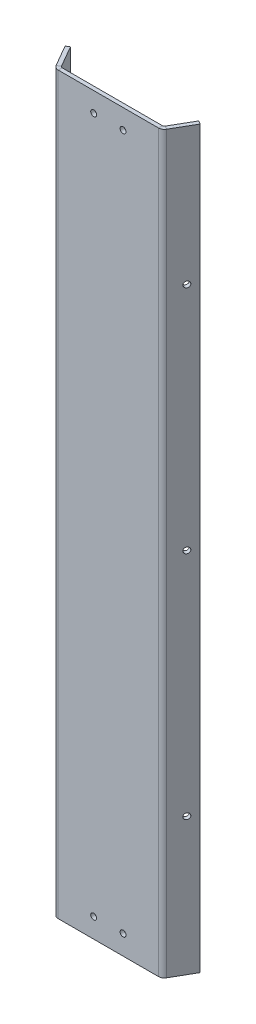
ISO-10303-21;
HEADER;
FILE_DESCRIPTION(('STEP AP214'),'2;1');
FILE_NAME('part.step','',(''),(''),'','','');
FILE_SCHEMA(('AUTOMOTIVE_DESIGN { 1 0 10303 214 1 1 1 1 }'));
ENDSEC;
DATA;
#1=APPLICATION_CONTEXT('core data for automotive mechanical design processes');
#2=APPLICATION_PROTOCOL_DEFINITION('international standard','automotive_design',2000,#1);
#3=PRODUCT_CONTEXT('',#1,'mechanical');
#4=PRODUCT('Part','Part','',(#3));
#5=PRODUCT_RELATED_PRODUCT_CATEGORY('part','',(#4));
#6=PRODUCT_DEFINITION_FORMATION('','',#4);
#7=PRODUCT_DEFINITION_CONTEXT('part definition',#1,'design');
#8=PRODUCT_DEFINITION('design','',#6,#7);
#9=PRODUCT_DEFINITION_SHAPE('','',#8);
#10=(LENGTH_UNIT() NAMED_UNIT(*) SI_UNIT(.MILLI.,.METRE.));
#11=(NAMED_UNIT(*) PLANE_ANGLE_UNIT() SI_UNIT($,.RADIAN.));
#12=(NAMED_UNIT(*) SI_UNIT($,.STERADIAN.) SOLID_ANGLE_UNIT());
#13=UNCERTAINTY_MEASURE_WITH_UNIT(LENGTH_MEASURE(1.E-05),#10,'distance_accuracy_value','');
#14=(GEOMETRIC_REPRESENTATION_CONTEXT(3) GLOBAL_UNCERTAINTY_ASSIGNED_CONTEXT((#13)) GLOBAL_UNIT_ASSIGNED_CONTEXT((#10,
#11,#12)) REPRESENTATION_CONTEXT('',''));
#15=CARTESIAN_POINT('',(0.,0.,0.));
#16=DIRECTION('',(0.,0.,1.));
#17=DIRECTION('',(1.,0.,0.));
#18=AXIS2_PLACEMENT_3D('',#15,#16,#17);
#19=CARTESIAN_POINT('',(0.,0.,2.));
#20=DIRECTION('',(0.,0.,1.));
#21=DIRECTION('',(1.,0.,0.));
#22=AXIS2_PLACEMENT_3D('',#19,#20,#21);
#23=PLANE('',#22);
#24=CARTESIAN_POINT('',(-5.3675504864885,10.,2.));
#25=DIRECTION('',(0.,0.,-1.));
#26=DIRECTION('',(-1.,0.,0.));
#27=AXIS2_PLACEMENT_3D('',#24,#25,#26);
#28=CIRCLE('',#27,1.49999999999999);
#29=CARTESIAN_POINT('',(-6.86755048648849,10.,2.));
#30=VERTEX_POINT('',#29);
#31=EDGE_CURVE('E229',#30,#30,#28,.T.);
#32=ORIENTED_EDGE('',*,*,#31,.F.);
#33=EDGE_LOOP('',(#32));
#34=FACE_BOUND('',#33,.T.);
#35=CARTESIAN_POINT('',(9.6324495135115,10.,2.));
#36=DIRECTION('',(0.,0.,-1.));
#37=DIRECTION('',(-1.,0.,0.));
#38=AXIS2_PLACEMENT_3D('',#35,#36,#37);
#39=CIRCLE('',#38,1.49999999999999);
#40=CARTESIAN_POINT('',(8.13244951351151,10.,2.));
#41=VERTEX_POINT('',#40);
#42=EDGE_CURVE('E226',#41,#41,#39,.T.);
#43=ORIENTED_EDGE('',*,*,#42,.F.);
#44=EDGE_LOOP('',(#43));
#45=FACE_BOUND('',#44,.T.);
#46=CARTESIAN_POINT('',(9.6324495135115,365.,2.));
#47=DIRECTION('',(0.,0.,-1.));
#48=DIRECTION('',(-1.,0.,0.));
#49=AXIS2_PLACEMENT_3D('',#46,#47,#48);
#50=CIRCLE('',#49,1.49999999999999);
#51=CARTESIAN_POINT('',(8.13244951351151,365.,2.));
#52=VERTEX_POINT('',#51);
#53=EDGE_CURVE('E223',#52,#52,#50,.T.);
#54=ORIENTED_EDGE('',*,*,#53,.F.);
#55=EDGE_LOOP('',(#54));
#56=FACE_BOUND('',#55,.T.);
#57=CARTESIAN_POINT('',(-5.3675504864885,365.,2.));
#58=DIRECTION('',(0.,0.,-1.));
#59=DIRECTION('',(-1.,0.,0.));
#60=AXIS2_PLACEMENT_3D('',#57,#58,#59);
#61=CIRCLE('',#60,1.49999999999999);
#62=CARTESIAN_POINT('',(-6.86755048648849,365.,2.));
#63=VERTEX_POINT('',#62);
#64=EDGE_CURVE('E220',#63,#63,#61,.T.);
#65=ORIENTED_EDGE('',*,*,#64,.F.);
#66=EDGE_LOOP('',(#65));
#67=FACE_BOUND('',#66,.T.);
#68=DIRECTION('',(-1.,0.,0.));
#69=VECTOR('',#68,1.);
#70=CARTESIAN_POINT('',(42.3815451542839,375.,2.));
#71=LINE('',#70,#69);
#72=CARTESIAN_POINT('',(27.7097997827011,375.,2.));
#73=VERTEX_POINT('',#72);
#74=CARTESIAN_POINT('',(-23.4449007556781,375.,2.));
#75=VERTEX_POINT('',#74);
#76=EDGE_CURVE('E51',#73,#75,#71,.T.);
#77=ORIENTED_EDGE('',*,*,#76,.F.);
#78=DIRECTION('',(0.,-1.,0.));
#79=VECTOR('',#78,1.);
#80=CARTESIAN_POINT('',(27.7097997827011,0.,2.));
#81=LINE('',#80,#79);
#82=CARTESIAN_POINT('',(27.7097997827011,0.,2.));
#83=VERTEX_POINT('',#82);
#84=EDGE_CURVE('E284',#73,#83,#81,.T.);
#85=ORIENTED_EDGE('',*,*,#84,.T.);
#86=DIRECTION('',(1.,0.,0.));
#87=VECTOR('',#86,1.);
#88=CARTESIAN_POINT('',(-38.1166461272609,0.,2.));
#89=LINE('',#88,#87);
#90=CARTESIAN_POINT('',(-23.4449007556781,0.,2.));
#91=VERTEX_POINT('',#90);
#92=EDGE_CURVE('E207',#91,#83,#89,.T.);
#93=ORIENTED_EDGE('',*,*,#92,.F.);
#94=DIRECTION('',(0.,1.,0.));
#95=VECTOR('',#94,1.);
#96=CARTESIAN_POINT('',(-23.4449007556781,0.,2.));
#97=LINE('',#96,#95);
#98=EDGE_CURVE('E217',#91,#75,#97,.T.);
#99=ORIENTED_EDGE('',*,*,#98,.T.);
#100=EDGE_LOOP('',(#77,#85,#93,#99));
#101=FACE_BOUND('',#100,.T.);
#102=ADVANCED_FACE('F47',(#34,#45,#56,#67,#101),#23,.F.);
#103=CARTESIAN_POINT('',(-13.2733290379958,0.,24.6176790078565));
#104=DIRECTION('',(-0.866025403784439,0.,0.499999999999999));
#105=DIRECTION('',(0.499999999999999,0.,0.866025403784439));
#106=AXIS2_PLACEMENT_3D('',#103,#104,#105);
#107=PLANE('',#106);
#108=CARTESIAN_POINT('',(-29.8316521016262,70.,-4.06217782649105));
#109=DIRECTION('',(-0.866025403784439,0.,0.499999999999999));
#110=DIRECTION('',(0.499999999999999,0.,0.866025403784439));
#111=AXIS2_PLACEMENT_3D('',#108,#109,#110);
#112=CIRCLE('',#111,1.49999999999998);
#113=CARTESIAN_POINT('',(-29.0816521016262,70.,-2.76313972081441));
#114=VERTEX_POINT('',#113);
#115=EDGE_CURVE('E240',#114,#114,#112,.T.);
#116=ORIENTED_EDGE('',*,*,#115,.F.);
#117=EDGE_LOOP('',(#116));
#118=FACE_BOUND('',#117,.T.);
#119=CARTESIAN_POINT('',(-29.831652101626,187.5,-4.06217782649071));
#120=DIRECTION('',(-0.866025403784439,0.,0.499999999999999));
#121=DIRECTION('',(0.499999999999999,0.,0.866025403784439));
#122=AXIS2_PLACEMENT_3D('',#119,#120,#121);
#123=CIRCLE('',#122,1.49999999999998);
#124=CARTESIAN_POINT('',(-29.081652101626,187.5,-2.76313972081407));
#125=VERTEX_POINT('',#124);
#126=EDGE_CURVE('E246',#125,#125,#123,.T.);
#127=ORIENTED_EDGE('',*,*,#126,.F.);
#128=EDGE_LOOP('',(#127));
#129=FACE_BOUND('',#128,.T.);
#130=CARTESIAN_POINT('',(-29.8316521016258,305.,-4.06217782649037));
#131=DIRECTION('',(-0.866025403784439,0.,0.499999999999999));
#132=DIRECTION('',(0.499999999999999,0.,0.866025403784439));
#133=AXIS2_PLACEMENT_3D('',#130,#131,#132);
#134=CIRCLE('',#133,1.49999999999998);
#135=CARTESIAN_POINT('',(-29.0816521016258,305.,-2.76313972081373));
#136=VERTEX_POINT('',#135);
#137=EDGE_CURVE('E252',#136,#136,#134,.T.);
#138=ORIENTED_EDGE('',*,*,#137,.F.);
#139=EDGE_LOOP('',(#138));
#140=FACE_BOUND('',#139,.T.);
#141=DIRECTION('',(0.499999999999999,0.,0.866025403784439));
#142=VECTOR('',#141,1.);
#143=CARTESIAN_POINT('',(-32.3316521016262,0.,-8.39230484541325));
#144=LINE('',#143,#142);
#145=CARTESIAN_POINT('',(-32.3316521016262,0.,-8.39230484541325));
#146=VERTEX_POINT('',#145);
#147=CARTESIAN_POINT('',(-26.0429769670314,0.,2.50000000000005));
#148=VERTEX_POINT('',#147);
#149=EDGE_CURVE('E266',#146,#148,#144,.T.);
#150=ORIENTED_EDGE('',*,*,#149,.T.);
#151=DIRECTION('',(0.,1.,0.));
#152=VECTOR('',#151,1.);
#153=CARTESIAN_POINT('',(-26.0429769670314,0.,2.50000000000003));
#154=LINE('',#153,#152);
#155=CARTESIAN_POINT('',(-26.0429769670314,375.,2.5));
#156=VERTEX_POINT('',#155);
#157=EDGE_CURVE('E278',#148,#156,#154,.T.);
#158=ORIENTED_EDGE('',*,*,#157,.T.);
#159=DIRECTION('',(-0.499999999999999,0.,-0.866025403784439));
#160=VECTOR('',#159,1.);
#161=CARTESIAN_POINT('',(7.91744353914615,375.,61.3211737631036));
#162=LINE('',#161,#160);
#163=CARTESIAN_POINT('',(-32.3316521016262,375.,-8.39230484541327));
#164=VERTEX_POINT('',#163);
#165=EDGE_CURVE('E263',#156,#164,#162,.T.);
#166=ORIENTED_EDGE('',*,*,#165,.T.);
#167=DIRECTION('',(0.,-1.,0.));
#168=VECTOR('',#167,1.);
#169=CARTESIAN_POINT('',(-32.3316521016262,375.,-8.39230484541327));
#170=LINE('',#169,#168);
#171=EDGE_CURVE('E258',#164,#146,#170,.T.);
#172=ORIENTED_EDGE('',*,*,#171,.T.);
#173=EDGE_LOOP('',(#150,#158,#166,#172));
#174=FACE_BOUND('',#173,.T.);
#175=ADVANCED_FACE('F355',(#118,#129,#140,#174),#107,.T.);
#176=CARTESIAN_POINT('',(9.64949434671503,375.,60.3211737631036));
#177=DIRECTION('',(0.,1.,0.));
#178=DIRECTION('',(-0.499999999999999,0.,-0.866025403784439));
#179=AXIS2_PLACEMENT_3D('',#176,#177,#178);
#180=PLANE('',#179);
#181=ORIENTED_EDGE('',*,*,#165,.F.);
#182=DIRECTION('',(0.866025403784439,0.,-0.499999999999999));
#183=VECTOR('',#182,1.);
#184=CARTESIAN_POINT('',(-24.3109261594625,375.,1.50000000000003));
#185=LINE('',#184,#183);
#186=CARTESIAN_POINT('',(-24.3109261594625,375.,1.49999999999999));
#187=VERTEX_POINT('',#186);
#188=EDGE_CURVE('E276',#156,#187,#185,.T.);
#189=ORIENTED_EDGE('',*,*,#188,.T.);
#190=DIRECTION('',(-0.499999999999999,0.,-0.866025403784439));
#191=VECTOR('',#190,1.);
#192=CARTESIAN_POINT('',(9.64949434671503,375.,60.3211737631036));
#193=LINE('',#192,#191);
#194=CARTESIAN_POINT('',(-30.5996012940573,375.,-9.39230484541326));
#195=VERTEX_POINT('',#194);
#196=EDGE_CURVE('E273',#187,#195,#193,.T.);
#197=ORIENTED_EDGE('',*,*,#196,.T.);
#198=DIRECTION('',(-0.866025403784439,0.,0.499999999999999));
#199=VECTOR('',#198,1.);
#200=CARTESIAN_POINT('',(-30.5996012940573,375.,-9.39230484541326));
#201=LINE('',#200,#199);
#202=EDGE_CURVE('E267',#195,#164,#201,.T.);
#203=ORIENTED_EDGE('',*,*,#202,.T.);
#204=EDGE_LOOP('',(#181,#189,#197,#203));
#205=FACE_BOUND('',#204,.T.);
#206=ADVANCED_FACE('F353',(#205),#180,.T.);
#207=CARTESIAN_POINT('',(-30.5996012940574,0.,-9.39230484541324));
#208=DIRECTION('',(0.,-1.,0.));
#209=DIRECTION('',(0.499999999999999,0.,0.866025403784439));
#210=AXIS2_PLACEMENT_3D('',#207,#208,#209);
#211=PLANE('',#210);
#212=DIRECTION('',(0.499999999999999,0.,0.866025403784439));
#213=VECTOR('',#212,1.);
#214=CARTESIAN_POINT('',(-30.5996012940574,0.,-9.39230484541324));
#215=LINE('',#214,#213);
#216=CARTESIAN_POINT('',(-30.5996012940574,0.,-9.39230484541324));
#217=VERTEX_POINT('',#216);
#218=CARTESIAN_POINT('',(-24.3109261594625,0.,1.50000000000005));
#219=VERTEX_POINT('',#218);
#220=EDGE_CURVE('E262',#217,#219,#215,.T.);
#221=ORIENTED_EDGE('',*,*,#220,.T.);
#222=DIRECTION('',(-0.866025403784439,0.,0.499999999999999));
#223=VECTOR('',#222,1.);
#224=CARTESIAN_POINT('',(-24.3109261594626,0.,1.50000000000003));
#225=LINE('',#224,#223);
#226=EDGE_CURVE('E281',#219,#148,#225,.T.);
#227=ORIENTED_EDGE('',*,*,#226,.T.);
#228=ORIENTED_EDGE('',*,*,#149,.F.);
#229=DIRECTION('',(-0.866025403784439,0.,0.499999999999999));
#230=VECTOR('',#229,1.);
#231=CARTESIAN_POINT('',(-30.5996012940574,0.,-9.39230484541324));
#232=LINE('',#231,#230);
#233=EDGE_CURVE('E271',#217,#146,#232,.T.);
#234=ORIENTED_EDGE('',*,*,#233,.F.);
#235=EDGE_LOOP('',(#221,#227,#228,#234));
#236=FACE_BOUND('',#235,.T.);
#237=ADVANCED_FACE('F346',(#236),#211,.T.);
#238=CARTESIAN_POINT('',(-30.5996012940573,375.,-9.39230484541326));
#239=DIRECTION('',(-0.499999999999999,0.,-0.866025403784439));
#240=DIRECTION('',(0.,-1.,0.));
#241=AXIS2_PLACEMENT_3D('',#238,#239,#240);
#242=PLANE('',#241);
#243=ORIENTED_EDGE('',*,*,#171,.F.);
#244=ORIENTED_EDGE('',*,*,#202,.F.);
#245=DIRECTION('',(0.,-1.,0.));
#246=VECTOR('',#245,1.);
#247=CARTESIAN_POINT('',(-30.5996012940573,375.,-9.39230484541326));
#248=LINE('',#247,#246);
#249=EDGE_CURVE('E259',#195,#217,#248,.T.);
#250=ORIENTED_EDGE('',*,*,#249,.T.);
#251=ORIENTED_EDGE('',*,*,#233,.T.);
#252=EDGE_LOOP('',(#243,#244,#250,#251));
#253=FACE_BOUND('',#252,.T.);
#254=ADVANCED_FACE('F350',(#253),#242,.T.);
#255=CARTESIAN_POINT('',(-11.5412782304269,0.,23.6176790078565));
#256=DIRECTION('',(-0.866025403784439,0.,0.499999999999999));
#257=DIRECTION('',(0.499999999999999,0.,0.866025403784439));
#258=AXIS2_PLACEMENT_3D('',#255,#256,#257);
#259=PLANE('',#258);
#260=DIRECTION('',(0.,1.,0.));
#261=VECTOR('',#260,1.);
#262=CARTESIAN_POINT('',(-24.3109261594626,0.,1.50000000000003));
#263=LINE('',#262,#261);
#264=EDGE_CURVE('E270',#219,#187,#263,.T.);
#265=ORIENTED_EDGE('',*,*,#264,.F.);
#266=ORIENTED_EDGE('',*,*,#220,.F.);
#267=ORIENTED_EDGE('',*,*,#249,.F.);
#268=ORIENTED_EDGE('',*,*,#196,.F.);
#269=EDGE_LOOP('',(#265,#266,#267,#268));
#270=FACE_BOUND('',#269,.T.);
#271=CARTESIAN_POINT('',(-28.0996012940572,70.,-5.06217782649113));
#272=DIRECTION('',(-0.866025403784439,0.,0.499999999999999));
#273=DIRECTION('',(0.499999999999999,0.,0.866025403784439));
#274=AXIS2_PLACEMENT_3D('',#271,#272,#273);
#275=CIRCLE('',#274,1.49999999999998);
#276=CARTESIAN_POINT('',(-27.3496012940572,70.,-3.76313972081449));
#277=VERTEX_POINT('',#276);
#278=EDGE_CURVE('E243',#277,#277,#275,.T.);
#279=ORIENTED_EDGE('',*,*,#278,.T.);
#280=EDGE_LOOP('',(#279));
#281=FACE_BOUND('',#280,.T.);
#282=CARTESIAN_POINT('',(-28.099601294057,187.5,-5.06217782649079));
#283=DIRECTION('',(-0.866025403784439,0.,0.499999999999999));
#284=DIRECTION('',(0.499999999999999,0.,0.866025403784439));
#285=AXIS2_PLACEMENT_3D('',#282,#283,#284);
#286=CIRCLE('',#285,1.49999999999998);
#287=CARTESIAN_POINT('',(-27.349601294057,187.5,-3.76313972081415));
#288=VERTEX_POINT('',#287);
#289=EDGE_CURVE('E249',#288,#288,#286,.T.);
#290=ORIENTED_EDGE('',*,*,#289,.T.);
#291=EDGE_LOOP('',(#290));
#292=FACE_BOUND('',#291,.T.);
#293=CARTESIAN_POINT('',(-28.0996012940568,305.,-5.06217782649045));
#294=DIRECTION('',(-0.866025403784439,0.,0.499999999999999));
#295=DIRECTION('',(0.499999999999999,0.,0.866025403784439));
#296=AXIS2_PLACEMENT_3D('',#293,#294,#295);
#297=CIRCLE('',#296,1.49999999999998);
#298=CARTESIAN_POINT('',(-27.3496012940568,305.,-3.76313972081381));
#299=VERTEX_POINT('',#298);
#300=EDGE_CURVE('E255',#299,#299,#297,.T.);
#301=ORIENTED_EDGE('',*,*,#300,.T.);
#302=EDGE_LOOP('',(#301));
#303=FACE_BOUND('',#302,.T.);
#304=ADVANCED_FACE('F342',(#270,#281,#292,#303),#259,.F.);
#305=CARTESIAN_POINT('',(-29.8316521016258,305.,-4.06217782649037));
#306=DIRECTION('',(-0.866025403784439,0.,0.499999999999999));
#307=DIRECTION('',(0.499999999999999,0.,0.866025403784439));
#308=AXIS2_PLACEMENT_3D('',#305,#306,#307);
#309=CYLINDRICAL_SURFACE('',#308,1.49999999999998);
#310=ORIENTED_EDGE('',*,*,#300,.F.);
#311=EDGE_LOOP('',(#310));
#312=FACE_BOUND('',#311,.T.);
#313=ORIENTED_EDGE('',*,*,#137,.T.);
#314=EDGE_LOOP('',(#313));
#315=FACE_BOUND('',#314,.T.);
#316=ADVANCED_FACE('F410',(#312,#315),#309,.F.);
#317=CARTESIAN_POINT('',(-29.831652101626,187.5,-4.06217782649071));
#318=DIRECTION('',(-0.866025403784439,0.,0.499999999999999));
#319=DIRECTION('',(0.499999999999999,0.,0.866025403784439));
#320=AXIS2_PLACEMENT_3D('',#317,#318,#319);
#321=CYLINDRICAL_SURFACE('',#320,1.49999999999998);
#322=ORIENTED_EDGE('',*,*,#289,.F.);
#323=EDGE_LOOP('',(#322));
#324=FACE_BOUND('',#323,.T.);
#325=ORIENTED_EDGE('',*,*,#126,.T.);
#326=EDGE_LOOP('',(#325));
#327=FACE_BOUND('',#326,.T.);
#328=ADVANCED_FACE('F406',(#324,#327),#321,.F.);
#329=CARTESIAN_POINT('',(-29.8316521016262,70.,-4.06217782649105));
#330=DIRECTION('',(-0.866025403784439,0.,0.499999999999999));
#331=DIRECTION('',(0.499999999999999,0.,0.866025403784439));
#332=AXIS2_PLACEMENT_3D('',#329,#330,#331);
#333=CYLINDRICAL_SURFACE('',#332,1.49999999999998);
#334=ORIENTED_EDGE('',*,*,#278,.F.);
#335=EDGE_LOOP('',(#334));
#336=FACE_BOUND('',#335,.T.);
#337=ORIENTED_EDGE('',*,*,#115,.T.);
#338=EDGE_LOOP('',(#337));
#339=FACE_BOUND('',#338,.T.);
#340=ADVANCED_FACE('F392',(#336,#339),#333,.F.);
#341=CARTESIAN_POINT('',(-5.3675504864885,10.,2.));
#342=DIRECTION('',(0.,0.,-1.));
#343=DIRECTION('',(-1.,0.,0.));
#344=AXIS2_PLACEMENT_3D('',#341,#342,#343);
#345=CYLINDRICAL_SURFACE('',#344,1.49999999999999);
#346=CARTESIAN_POINT('',(-5.3675504864885,10.,4.00000000000001));
#347=DIRECTION('',(0.,0.,-1.));
#348=DIRECTION('',(-1.,0.,0.));
#349=AXIS2_PLACEMENT_3D('',#346,#347,#348);
#350=CIRCLE('',#349,1.49999999999999);
#351=CARTESIAN_POINT('',(-6.86755048648849,10.,4.00000000000001));
#352=VERTEX_POINT('',#351);
#353=EDGE_CURVE('E214',#352,#352,#350,.T.);
#354=ORIENTED_EDGE('',*,*,#353,.F.);
#355=EDGE_LOOP('',(#354));
#356=FACE_BOUND('',#355,.T.);
#357=ORIENTED_EDGE('',*,*,#31,.T.);
#358=EDGE_LOOP('',(#357));
#359=FACE_BOUND('',#358,.T.);
#360=ADVANCED_FACE('F388',(#356,#359),#345,.F.);
#361=CARTESIAN_POINT('',(9.6324495135115,10.,2.));
#362=DIRECTION('',(0.,0.,-1.));
#363=DIRECTION('',(-1.,0.,0.));
#364=AXIS2_PLACEMENT_3D('',#361,#362,#363);
#365=CYLINDRICAL_SURFACE('',#364,1.49999999999999);
#366=CARTESIAN_POINT('',(9.6324495135115,10.,4.00000000000001));
#367=DIRECTION('',(0.,0.,-1.));
#368=DIRECTION('',(-1.,0.,0.));
#369=AXIS2_PLACEMENT_3D('',#366,#367,#368);
#370=CIRCLE('',#369,1.49999999999999);
#371=CARTESIAN_POINT('',(8.13244951351151,10.,4.00000000000001));
#372=VERTEX_POINT('',#371);
#373=EDGE_CURVE('E211',#372,#372,#370,.T.);
#374=ORIENTED_EDGE('',*,*,#373,.F.);
#375=EDGE_LOOP('',(#374));
#376=FACE_BOUND('',#375,.T.);
#377=ORIENTED_EDGE('',*,*,#42,.T.);
#378=EDGE_LOOP('',(#377));
#379=FACE_BOUND('',#378,.T.);
#380=ADVANCED_FACE('F391',(#376,#379),#365,.F.);
#381=CARTESIAN_POINT('',(9.6324495135115,365.,2.));
#382=DIRECTION('',(0.,0.,-1.));
#383=DIRECTION('',(-1.,0.,0.));
#384=AXIS2_PLACEMENT_3D('',#381,#382,#383);
#385=CYLINDRICAL_SURFACE('',#384,1.49999999999999);
#386=CARTESIAN_POINT('',(9.6324495135115,365.,4.00000000000001));
#387=DIRECTION('',(0.,0.,-1.));
#388=DIRECTION('',(-1.,0.,0.));
#389=AXIS2_PLACEMENT_3D('',#386,#387,#388);
#390=CIRCLE('',#389,1.49999999999999);
#391=CARTESIAN_POINT('',(8.13244951351151,365.,4.00000000000001));
#392=VERTEX_POINT('',#391);
#393=EDGE_CURVE('E204',#392,#392,#390,.T.);
#394=ORIENTED_EDGE('',*,*,#393,.F.);
#395=EDGE_LOOP('',(#394));
#396=FACE_BOUND('',#395,.T.);
#397=ORIENTED_EDGE('',*,*,#53,.T.);
#398=EDGE_LOOP('',(#397));
#399=FACE_BOUND('',#398,.T.);
#400=ADVANCED_FACE('F396',(#396,#399),#385,.F.);
#401=CARTESIAN_POINT('',(-5.3675504864885,365.,2.));
#402=DIRECTION('',(0.,0.,-1.));
#403=DIRECTION('',(-1.,0.,0.));
#404=AXIS2_PLACEMENT_3D('',#401,#402,#403);
#405=CYLINDRICAL_SURFACE('',#404,1.49999999999999);
#406=CARTESIAN_POINT('',(-5.3675504864885,365.,4.00000000000001));
#407=DIRECTION('',(0.,0.,-1.));
#408=DIRECTION('',(-1.,0.,0.));
#409=AXIS2_PLACEMENT_3D('',#406,#407,#408);
#410=CIRCLE('',#409,1.49999999999999);
#411=CARTESIAN_POINT('',(-6.86755048648849,365.,4.00000000000001));
#412=VERTEX_POINT('',#411);
#413=EDGE_CURVE('E208',#412,#412,#410,.T.);
#414=ORIENTED_EDGE('',*,*,#413,.F.);
#415=EDGE_LOOP('',(#414));
#416=FACE_BOUND('',#415,.T.);
#417=ORIENTED_EDGE('',*,*,#64,.T.);
#418=EDGE_LOOP('',(#417));
#419=FACE_BOUND('',#418,.T.);
#420=ADVANCED_FACE('F373',(#416,#419),#405,.F.);
#421=CARTESIAN_POINT('',(42.3815451542839,375.,2.));
#422=DIRECTION('',(0.,1.,0.));
#423=DIRECTION('',(-1.,0.,0.));
#424=AXIS2_PLACEMENT_3D('',#421,#422,#423);
#425=PLANE('',#424);
#426=DIRECTION('',(0.,0.,1.));
#427=VECTOR('',#426,1.);
#428=CARTESIAN_POINT('',(27.7097997827011,375.,2.));
#429=LINE('',#428,#427);
#430=CARTESIAN_POINT('',(27.7097997827011,375.,4.));
#431=VERTEX_POINT('',#430);
#432=EDGE_CURVE('E292',#73,#431,#429,.T.);
#433=ORIENTED_EDGE('',*,*,#432,.F.);
#434=ORIENTED_EDGE('',*,*,#76,.T.);
#435=DIRECTION('',(0.,0.,-1.));
#436=VECTOR('',#435,1.);
#437=CARTESIAN_POINT('',(-23.444900755678,375.,2.));
#438=LINE('',#437,#436);
#439=CARTESIAN_POINT('',(-23.444900755678,375.,4.));
#440=VERTEX_POINT('',#439);
#441=EDGE_CURVE('E232',#440,#75,#438,.T.);
#442=ORIENTED_EDGE('',*,*,#441,.F.);
#443=DIRECTION('',(-1.,0.,0.));
#444=VECTOR('',#443,1.);
#445=CARTESIAN_POINT('',(42.3815451542839,375.,4.));
#446=LINE('',#445,#444);
#447=EDGE_CURVE('E72',#431,#440,#446,.T.);
#448=ORIENTED_EDGE('',*,*,#447,.F.);
#449=EDGE_LOOP('',(#433,#434,#442,#448));
#450=FACE_BOUND('',#449,.T.);
#451=ADVANCED_FACE('F300',(#450),#425,.T.);
#452=CARTESIAN_POINT('',(0.,0.,4.));
#453=DIRECTION('',(0.,0.,1.));
#454=DIRECTION('',(1.,0.,0.));
#455=AXIS2_PLACEMENT_3D('',#452,#453,#454);
#456=PLANE('',#455);
#457=DIRECTION('',(0.,-1.,0.));
#458=VECTOR('',#457,1.);
#459=CARTESIAN_POINT('',(27.7097997827011,0.,4.));
#460=LINE('',#459,#458);
#461=CARTESIAN_POINT('',(27.7097997827011,0.,4.));
#462=VERTEX_POINT('',#461);
#463=EDGE_CURVE('E56',#431,#462,#460,.T.);
#464=ORIENTED_EDGE('',*,*,#463,.F.);
#465=ORIENTED_EDGE('',*,*,#447,.T.);
#466=DIRECTION('',(0.,1.,0.));
#467=VECTOR('',#466,1.);
#468=CARTESIAN_POINT('',(-23.4449007556781,0.,4.));
#469=LINE('',#468,#467);
#470=CARTESIAN_POINT('',(-23.4449007556781,0.,4.));
#471=VERTEX_POINT('',#470);
#472=EDGE_CURVE('E235',#471,#440,#469,.T.);
#473=ORIENTED_EDGE('',*,*,#472,.F.);
#474=DIRECTION('',(1.,0.,0.));
#475=VECTOR('',#474,1.);
#476=CARTESIAN_POINT('',(-38.1166461272609,0.,4.));
#477=LINE('',#476,#475);
#478=EDGE_CURVE('E64',#471,#462,#477,.T.);
#479=ORIENTED_EDGE('',*,*,#478,.T.);
#480=EDGE_LOOP('',(#464,#465,#473,#479));
#481=FACE_BOUND('',#480,.T.);
#482=ORIENTED_EDGE('',*,*,#353,.T.);
#483=EDGE_LOOP('',(#482));
#484=FACE_BOUND('',#483,.T.);
#485=ORIENTED_EDGE('',*,*,#373,.T.);
#486=EDGE_LOOP('',(#485));
#487=FACE_BOUND('',#486,.T.);
#488=ORIENTED_EDGE('',*,*,#413,.T.);
#489=EDGE_LOOP('',(#488));
#490=FACE_BOUND('',#489,.T.);
#491=ORIENTED_EDGE('',*,*,#393,.T.);
#492=EDGE_LOOP('',(#491));
#493=FACE_BOUND('',#492,.T.);
#494=ADVANCED_FACE('F298',(#481,#484,#487,#490,#493),#456,.T.);
#495=CARTESIAN_POINT('',(-38.1166461272609,0.,2.));
#496=DIRECTION('',(0.,-1.,0.));
#497=DIRECTION('',(1.,0.,0.));
#498=AXIS2_PLACEMENT_3D('',#495,#496,#497);
#499=PLANE('',#498);
#500=DIRECTION('',(0.,0.,-1.));
#501=VECTOR('',#500,1.);
#502=CARTESIAN_POINT('',(27.7097997827011,0.,2.));
#503=LINE('',#502,#501);
#504=EDGE_CURVE('E12',#462,#83,#503,.T.);
#505=ORIENTED_EDGE('',*,*,#504,.F.);
#506=ORIENTED_EDGE('',*,*,#478,.F.);
#507=DIRECTION('',(0.,0.,1.));
#508=VECTOR('',#507,1.);
#509=CARTESIAN_POINT('',(-23.4449007556781,0.,2.));
#510=LINE('',#509,#508);
#511=EDGE_CURVE('E199',#91,#471,#510,.T.);
#512=ORIENTED_EDGE('',*,*,#511,.F.);
#513=ORIENTED_EDGE('',*,*,#92,.T.);
#514=EDGE_LOOP('',(#505,#506,#512,#513));
#515=FACE_BOUND('',#514,.T.);
#516=ADVANCED_FACE('F49',(#515),#499,.T.);
#517=CARTESIAN_POINT('',(-23.4449007556781,0.,1.));
#518=DIRECTION('',(0.,1.,0.));
#519=DIRECTION('',(-1.,0.,0.));
#520=AXIS2_PLACEMENT_3D('',#517,#518,#519);
#521=PLANE('',#520);
#522=ORIENTED_EDGE('',*,*,#511,.T.);
#523=CARTESIAN_POINT('',(-23.4449007556781,0.,1.));
#524=DIRECTION('',(0.,1.,0.));
#525=DIRECTION('',(-1.,0.,0.));
#526=AXIS2_PLACEMENT_3D('',#523,#524,#525);
#527=CIRCLE('',#526,3.);
#528=EDGE_CURVE('E187',#471,#148,#527,.F.);
#529=ORIENTED_EDGE('',*,*,#528,.T.);
#530=ORIENTED_EDGE('',*,*,#226,.F.);
#531=CARTESIAN_POINT('',(-23.4449007556781,0.,1.));
#532=DIRECTION('',(0.,-1.,0.));
#533=DIRECTION('',(-1.,0.,0.));
#534=AXIS2_PLACEMENT_3D('',#531,#532,#533);
#535=CIRCLE('',#534,0.999999999999998);
#536=EDGE_CURVE('E192',#91,#219,#535,.T.);
#537=ORIENTED_EDGE('',*,*,#536,.F.);
#538=EDGE_LOOP('',(#522,#529,#530,#537));
#539=FACE_BOUND('',#538,.T.);
#540=ADVANCED_FACE('F312',(#539),#521,.F.);
#541=CARTESIAN_POINT('',(-23.444900755678,375.,1.));
#542=DIRECTION('',(0.,-1.,0.));
#543=DIRECTION('',(0.,0.,-1.));
#544=AXIS2_PLACEMENT_3D('',#541,#542,#543);
#545=PLANE('',#544);
#546=ORIENTED_EDGE('',*,*,#188,.F.);
#547=CARTESIAN_POINT('',(-23.444900755678,375.,1.));
#548=DIRECTION('',(0.,1.,0.));
#549=DIRECTION('',(-1.,0.,0.));
#550=AXIS2_PLACEMENT_3D('',#547,#548,#549);
#551=CIRCLE('',#550,3.);
#552=EDGE_CURVE('E196',#156,#440,#551,.T.);
#553=ORIENTED_EDGE('',*,*,#552,.T.);
#554=ORIENTED_EDGE('',*,*,#441,.T.);
#555=CARTESIAN_POINT('',(-23.444900755678,375.,1.));
#556=DIRECTION('',(0.,1.,0.));
#557=DIRECTION('',(0.,0.,-1.));
#558=AXIS2_PLACEMENT_3D('',#555,#556,#557);
#559=CIRCLE('',#558,0.999999999999998);
#560=EDGE_CURVE('E195',#187,#75,#559,.T.);
#561=ORIENTED_EDGE('',*,*,#560,.F.);
#562=EDGE_LOOP('',(#546,#553,#554,#561));
#563=FACE_BOUND('',#562,.T.);
#564=ADVANCED_FACE('F305',(#563),#545,.F.);
#565=CARTESIAN_POINT('',(-23.4449007556781,-187.511181821082,1.));
#566=DIRECTION('',(0.,1.,0.));
#567=DIRECTION('',(-1.,0.,0.));
#568=AXIS2_PLACEMENT_3D('',#565,#566,#567);
#569=CYLINDRICAL_SURFACE('',#568,1.);
#570=ORIENTED_EDGE('',*,*,#560,.T.);
#571=ORIENTED_EDGE('',*,*,#98,.F.);
#572=ORIENTED_EDGE('',*,*,#536,.T.);
#573=ORIENTED_EDGE('',*,*,#264,.T.);
#574=EDGE_LOOP('',(#570,#571,#572,#573));
#575=FACE_BOUND('',#574,.T.);
#576=ADVANCED_FACE('F338',(#575),#569,.F.);
#577=CARTESIAN_POINT('',(-23.4449007556781,-187.511181821082,1.));
#578=DIRECTION('',(0.,1.,0.));
#579=DIRECTION('',(-1.,0.,0.));
#580=AXIS2_PLACEMENT_3D('',#577,#578,#579);
#581=CYLINDRICAL_SURFACE('',#580,3.);
#582=ORIENTED_EDGE('',*,*,#552,.F.);
#583=ORIENTED_EDGE('',*,*,#157,.F.);
#584=ORIENTED_EDGE('',*,*,#528,.F.);
#585=ORIENTED_EDGE('',*,*,#472,.T.);
#586=EDGE_LOOP('',(#582,#583,#584,#585));
#587=FACE_BOUND('',#586,.T.);
#588=ADVANCED_FACE('F309',(#587),#581,.T.);
#589=CARTESIAN_POINT('',(27.7097997827011,375.,1.));
#590=DIRECTION('',(0.,-1.,0.));
#591=DIRECTION('',(0.,0.,-1.));
#592=AXIS2_PLACEMENT_3D('',#589,#590,#591);
#593=PLANE('',#592);
#594=ORIENTED_EDGE('',*,*,#432,.T.);
#595=CARTESIAN_POINT('',(27.7097997827011,375.,1.));
#596=DIRECTION('',(0.,-1.,0.));
#597=DIRECTION('',(0.,0.,-1.));
#598=AXIS2_PLACEMENT_3D('',#595,#596,#597);
#599=CIRCLE('',#598,3.);
#600=CARTESIAN_POINT('',(30.3078759940544,375.,2.50000000000002));
#601=VERTEX_POINT('',#600);
#602=EDGE_CURVE('E157',#431,#601,#599,.F.);
#603=ORIENTED_EDGE('',*,*,#602,.T.);
#604=DIRECTION('',(0.866025403784435,0.,0.500000000000006));
#605=VECTOR('',#604,1.);
#606=CARTESIAN_POINT('',(28.5758251864855,375.,1.50000000000001));
#607=LINE('',#606,#605);
#608=CARTESIAN_POINT('',(28.5758251864855,375.,1.50000000000001));
#609=VERTEX_POINT('',#608);
#610=EDGE_CURVE('E332',#609,#601,#607,.T.);
#611=ORIENTED_EDGE('',*,*,#610,.F.);
#612=CARTESIAN_POINT('',(27.7097997827011,375.,1.));
#613=DIRECTION('',(0.,1.,0.));
#614=DIRECTION('',(0.,0.,-1.));
#615=AXIS2_PLACEMENT_3D('',#612,#613,#614);
#616=CIRCLE('',#615,1.);
#617=EDGE_CURVE('E180',#73,#609,#616,.T.);
#618=ORIENTED_EDGE('',*,*,#617,.F.);
#619=EDGE_LOOP('',(#594,#603,#611,#618));
#620=FACE_BOUND('',#619,.T.);
#621=ADVANCED_FACE('F329',(#620),#593,.F.);
#622=CARTESIAN_POINT('',(27.7097997827011,0.,1.));
#623=DIRECTION('',(0.,1.,0.));
#624=DIRECTION('',(0.,0.,1.));
#625=AXIS2_PLACEMENT_3D('',#622,#623,#624);
#626=PLANE('',#625);
#627=DIRECTION('',(-0.866025403784435,0.,-0.500000000000006));
#628=VECTOR('',#627,1.);
#629=CARTESIAN_POINT('',(28.5758251864855,0.,1.50000000000001));
#630=LINE('',#629,#628);
#631=CARTESIAN_POINT('',(30.3078759940544,0.,2.50000000000002));
#632=VERTEX_POINT('',#631);
#633=CARTESIAN_POINT('',(28.5758251864855,0.,1.50000000000001));
#634=VERTEX_POINT('',#633);
#635=EDGE_CURVE('E145',#632,#634,#630,.T.);
#636=ORIENTED_EDGE('',*,*,#635,.F.);
#637=CARTESIAN_POINT('',(27.7097997827011,0.,1.));
#638=DIRECTION('',(0.,-1.,0.));
#639=DIRECTION('',(0.,0.,-1.));
#640=AXIS2_PLACEMENT_3D('',#637,#638,#639);
#641=CIRCLE('',#640,3.);
#642=EDGE_CURVE('E184',#632,#462,#641,.T.);
#643=ORIENTED_EDGE('',*,*,#642,.T.);
#644=ORIENTED_EDGE('',*,*,#504,.T.);
#645=CARTESIAN_POINT('',(27.7097997827011,0.,1.));
#646=DIRECTION('',(0.,-1.,0.));
#647=DIRECTION('',(0.,0.,1.));
#648=AXIS2_PLACEMENT_3D('',#645,#646,#647);
#649=CIRCLE('',#648,1.);
#650=EDGE_CURVE('E183',#634,#83,#649,.T.);
#651=ORIENTED_EDGE('',*,*,#650,.F.);
#652=EDGE_LOOP('',(#636,#643,#644,#651));
#653=FACE_BOUND('',#652,.T.);
#654=ADVANCED_FACE('F320',(#653),#626,.F.);
#655=CARTESIAN_POINT('',(27.7097997827011,562.511181821082,1.));
#656=DIRECTION('',(0.,-1.,0.));
#657=DIRECTION('',(0.,0.,-1.));
#658=AXIS2_PLACEMENT_3D('',#655,#656,#657);
#659=CYLINDRICAL_SURFACE('',#658,1.);
#660=ORIENTED_EDGE('',*,*,#650,.T.);
#661=ORIENTED_EDGE('',*,*,#84,.F.);
#662=ORIENTED_EDGE('',*,*,#617,.T.);
#663=DIRECTION('',(0.,-1.,0.));
#664=VECTOR('',#663,1.);
#665=CARTESIAN_POINT('',(28.5758251864855,0.,1.50000000000001));
#666=LINE('',#665,#664);
#667=EDGE_CURVE('E178',#609,#634,#666,.T.);
#668=ORIENTED_EDGE('',*,*,#667,.T.);
#669=EDGE_LOOP('',(#660,#661,#662,#668));
#670=FACE_BOUND('',#669,.T.);
#671=ADVANCED_FACE('F335',(#670),#659,.F.);
#672=CARTESIAN_POINT('',(27.7097997827011,562.511181821082,1.));
#673=DIRECTION('',(0.,-1.,0.));
#674=DIRECTION('',(0.,0.,-1.));
#675=AXIS2_PLACEMENT_3D('',#672,#673,#674);
#676=CYLINDRICAL_SURFACE('',#675,3.);
#677=ORIENTED_EDGE('',*,*,#642,.F.);
#678=DIRECTION('',(0.,-1.,0.));
#679=VECTOR('',#678,1.);
#680=CARTESIAN_POINT('',(30.3078759940544,0.,2.50000000000002));
#681=LINE('',#680,#679);
#682=EDGE_CURVE('E326',#601,#632,#681,.T.);
#683=ORIENTED_EDGE('',*,*,#682,.F.);
#684=ORIENTED_EDGE('',*,*,#602,.F.);
#685=ORIENTED_EDGE('',*,*,#463,.T.);
#686=EDGE_LOOP('',(#677,#683,#684,#685));
#687=FACE_BOUND('',#686,.T.);
#688=ADVANCED_FACE('F324',(#687),#676,.T.);
#689=CARTESIAN_POINT('',(34.0965511286493,70.,-4.06217782649107));
#690=DIRECTION('',(0.866025403784435,0.,0.500000000000006));
#691=DIRECTION('',(0.500000000000006,0.,-0.866025403784435));
#692=AXIS2_PLACEMENT_3D('',#689,#690,#691);
#693=CYLINDRICAL_SURFACE('',#692,1.49999999999998);
#694=CARTESIAN_POINT('',(32.3645003210802,70.,-5.06217782649116));
#695=DIRECTION('',(0.866025403784435,0.,0.500000000000006));
#696=DIRECTION('',(0.500000000000006,0.,-0.866025403784435));
#697=AXIS2_PLACEMENT_3D('',#694,#695,#696);
#698=CIRCLE('',#697,1.49999999999998);
#699=CARTESIAN_POINT('',(33.1145003210802,70.,-6.3612159321678));
#700=VERTEX_POINT('',#699);
#701=EDGE_CURVE('E689',#700,#700,#698,.T.);
#702=ORIENTED_EDGE('',*,*,#701,.F.);
#703=EDGE_LOOP('',(#702));
#704=FACE_BOUND('',#703,.T.);
#705=CARTESIAN_POINT('',(34.0965511286493,70.,-4.06217782649107));
#706=DIRECTION('',(0.866025403784435,0.,0.500000000000006));
#707=DIRECTION('',(0.500000000000006,0.,-0.866025403784435));
#708=AXIS2_PLACEMENT_3D('',#705,#706,#707);
#709=CIRCLE('',#708,1.49999999999998);
#710=CARTESIAN_POINT('',(34.8465511286493,70.,-5.3612159321677));
#711=VERTEX_POINT('',#710);
#712=EDGE_CURVE('E175',#711,#711,#709,.T.);
#713=ORIENTED_EDGE('',*,*,#712,.T.);
#714=EDGE_LOOP('',(#713));
#715=FACE_BOUND('',#714,.T.);
#716=ADVANCED_FACE('F506',(#704,#715),#693,.F.);
#717=CARTESIAN_POINT('',(34.0965511286491,187.5,-4.06217782649072));
#718=DIRECTION('',(0.866025403784435,0.,0.500000000000006));
#719=DIRECTION('',(0.500000000000006,0.,-0.866025403784435));
#720=AXIS2_PLACEMENT_3D('',#717,#718,#719);
#721=CYLINDRICAL_SURFACE('',#720,1.49999999999998);
#722=CARTESIAN_POINT('',(32.36450032108,187.5,-5.06217782649081));
#723=DIRECTION('',(0.866025403784435,0.,0.500000000000006));
#724=DIRECTION('',(0.500000000000006,0.,-0.866025403784435));
#725=AXIS2_PLACEMENT_3D('',#722,#723,#724);
#726=CIRCLE('',#725,1.49999999999998);
#727=CARTESIAN_POINT('',(33.11450032108,187.5,-6.36121593216745));
#728=VERTEX_POINT('',#727);
#729=EDGE_CURVE('E695',#728,#728,#726,.T.);
#730=ORIENTED_EDGE('',*,*,#729,.F.);
#731=EDGE_LOOP('',(#730));
#732=FACE_BOUND('',#731,.T.);
#733=CARTESIAN_POINT('',(34.0965511286491,187.5,-4.06217782649072));
#734=DIRECTION('',(0.866025403784435,0.,0.500000000000006));
#735=DIRECTION('',(0.500000000000006,0.,-0.866025403784435));
#736=AXIS2_PLACEMENT_3D('',#733,#734,#735);
#737=CIRCLE('',#736,1.49999999999998);
#738=CARTESIAN_POINT('',(34.8465511286491,187.5,-5.36121593216736));
#739=VERTEX_POINT('',#738);
#740=EDGE_CURVE('E169',#739,#739,#737,.T.);
#741=ORIENTED_EDGE('',*,*,#740,.T.);
#742=EDGE_LOOP('',(#741));
#743=FACE_BOUND('',#742,.T.);
#744=ADVANCED_FACE('F517',(#732,#743),#721,.F.);
#745=CARTESIAN_POINT('',(34.0965511286488,305.,-4.06217782649037));
#746=DIRECTION('',(0.866025403784435,0.,0.500000000000006));
#747=DIRECTION('',(0.500000000000006,0.,-0.866025403784435));
#748=AXIS2_PLACEMENT_3D('',#745,#746,#747);
#749=CYLINDRICAL_SURFACE('',#748,1.49999999999998);
#750=CARTESIAN_POINT('',(32.3645003210798,305.,-5.06217782649047));
#751=DIRECTION('',(0.866025403784435,0.,0.500000000000006));
#752=DIRECTION('',(0.500000000000006,0.,-0.866025403784435));
#753=AXIS2_PLACEMENT_3D('',#750,#751,#752);
#754=CIRCLE('',#753,1.49999999999998);
#755=CARTESIAN_POINT('',(33.1145003210798,305.,-6.3612159321671));
#756=VERTEX_POINT('',#755);
#757=EDGE_CURVE('E166',#756,#756,#754,.T.);
#758=ORIENTED_EDGE('',*,*,#757,.F.);
#759=EDGE_LOOP('',(#758));
#760=FACE_BOUND('',#759,.T.);
#761=CARTESIAN_POINT('',(34.0965511286488,305.,-4.06217782649037));
#762=DIRECTION('',(0.866025403784435,0.,0.500000000000006));
#763=DIRECTION('',(0.500000000000006,0.,-0.866025403784435));
#764=AXIS2_PLACEMENT_3D('',#761,#762,#763);
#765=CIRCLE('',#764,1.49999999999998);
#766=CARTESIAN_POINT('',(34.8465511286489,305.,-5.36121593216701));
#767=VERTEX_POINT('',#766);
#768=EDGE_CURVE('E164',#767,#767,#765,.T.);
#769=ORIENTED_EDGE('',*,*,#768,.T.);
#770=EDGE_LOOP('',(#769));
#771=FACE_BOUND('',#770,.T.);
#772=ADVANCED_FACE('F527',(#760,#771),#749,.F.);
#773=CARTESIAN_POINT('',(34.8645003210804,0.,-9.39230484541324));
#774=DIRECTION('',(0.500000000000006,0.,-0.866025403784435));
#775=DIRECTION('',(-0.866025403784435,0.,-0.500000000000006));
#776=AXIS2_PLACEMENT_3D('',#773,#774,#775);
#777=PLANE('',#776);
#778=DIRECTION('',(0.,1.,0.));
#779=VECTOR('',#778,1.);
#780=CARTESIAN_POINT('',(36.5965511286493,0.,-8.39230484541323));
#781=LINE('',#780,#779);
#782=CARTESIAN_POINT('',(36.5965511286493,0.,-8.39230484541323));
#783=VERTEX_POINT('',#782);
#784=CARTESIAN_POINT('',(36.5965511286493,375.,-8.39230484541323));
#785=VERTEX_POINT('',#784);
#786=EDGE_CURVE('E156',#783,#785,#781,.T.);
#787=ORIENTED_EDGE('',*,*,#786,.F.);
#788=DIRECTION('',(0.866025403784435,0.,0.500000000000006));
#789=VECTOR('',#788,1.);
#790=CARTESIAN_POINT('',(34.8645003210804,0.,-9.39230484541324));
#791=LINE('',#790,#789);
#792=CARTESIAN_POINT('',(34.8645003210804,0.,-9.39230484541324));
#793=VERTEX_POINT('',#792);
#794=EDGE_CURVE('E142',#793,#783,#791,.T.);
#795=ORIENTED_EDGE('',*,*,#794,.F.);
#796=DIRECTION('',(0.,1.,0.));
#797=VECTOR('',#796,1.);
#798=CARTESIAN_POINT('',(34.8645003210804,0.,-9.39230484541324));
#799=LINE('',#798,#797);
#800=CARTESIAN_POINT('',(34.8645003210804,375.,-9.39230484541324));
#801=VERTEX_POINT('',#800);
#802=EDGE_CURVE('E153',#793,#801,#799,.T.);
#803=ORIENTED_EDGE('',*,*,#802,.T.);
#804=DIRECTION('',(0.866025403784435,0.,0.500000000000006));
#805=VECTOR('',#804,1.);
#806=CARTESIAN_POINT('',(34.8645003210804,375.,-9.39230484541324));
#807=LINE('',#806,#805);
#808=EDGE_CURVE('E163',#801,#785,#807,.T.);
#809=ORIENTED_EDGE('',*,*,#808,.T.);
#810=EDGE_LOOP('',(#787,#795,#803,#809));
#811=FACE_BOUND('',#810,.T.);
#812=ADVANCED_FACE('F152',(#811),#777,.T.);
#813=CARTESIAN_POINT('',(13.6737277439382,0.,27.3111899098337));
#814=DIRECTION('',(0.866025403784435,0.,0.500000000000006));
#815=DIRECTION('',(0.500000000000006,0.,-0.866025403784435));
#816=AXIS2_PLACEMENT_3D('',#813,#814,#815);
#817=PLANE('',#816);
#818=ORIENTED_EDGE('',*,*,#667,.F.);
#819=DIRECTION('',(-0.500000000000006,0.,0.866025403784435));
#820=VECTOR('',#819,1.);
#821=CARTESIAN_POINT('',(34.8645003210804,375.,-9.39230484541324));
#822=LINE('',#821,#820);
#823=EDGE_CURVE('E162',#801,#609,#822,.T.);
#824=ORIENTED_EDGE('',*,*,#823,.F.);
#825=ORIENTED_EDGE('',*,*,#802,.F.);
#826=DIRECTION('',(0.500000000000006,0.,-0.866025403784435));
#827=VECTOR('',#826,1.);
#828=CARTESIAN_POINT('',(-5.38459531969251,0.,60.3211737631033));
#829=LINE('',#828,#827);
#830=EDGE_CURVE('E139',#634,#793,#829,.T.);
#831=ORIENTED_EDGE('',*,*,#830,.F.);
#832=EDGE_LOOP('',(#818,#824,#825,#831));
#833=FACE_BOUND('',#832,.T.);
#834=ORIENTED_EDGE('',*,*,#757,.T.);
#835=EDGE_LOOP('',(#834));
#836=FACE_BOUND('',#835,.T.);
#837=ORIENTED_EDGE('',*,*,#729,.T.);
#838=EDGE_LOOP('',(#837));
#839=FACE_BOUND('',#838,.T.);
#840=ORIENTED_EDGE('',*,*,#701,.T.);
#841=EDGE_LOOP('',(#840));
#842=FACE_BOUND('',#841,.T.);
#843=ADVANCED_FACE('F159',(#833,#836,#839,#842),#817,.F.);
#844=CARTESIAN_POINT('',(34.8645003210804,375.,-9.39230484541324));
#845=DIRECTION('',(0.,1.,0.));
#846=DIRECTION('',(-0.500000000000006,0.,0.866025403784435));
#847=AXIS2_PLACEMENT_3D('',#844,#845,#846);
#848=PLANE('',#847);
#849=ORIENTED_EDGE('',*,*,#823,.T.);
#850=ORIENTED_EDGE('',*,*,#610,.T.);
#851=DIRECTION('',(-0.500000000000006,0.,0.866025403784435));
#852=VECTOR('',#851,1.);
#853=CARTESIAN_POINT('',(36.5965511286493,375.,-8.39230484541323));
#854=LINE('',#853,#852);
#855=EDGE_CURVE('E686',#785,#601,#854,.T.);
#856=ORIENTED_EDGE('',*,*,#855,.F.);
#857=ORIENTED_EDGE('',*,*,#808,.F.);
#858=EDGE_LOOP('',(#849,#850,#856,#857));
#859=FACE_BOUND('',#858,.T.);
#860=ADVANCED_FACE('F555',(#859),#848,.T.);
#861=CARTESIAN_POINT('',(15.4057785515071,0.,28.3111899098338));
#862=DIRECTION('',(0.866025403784435,0.,0.500000000000006));
#863=DIRECTION('',(0.500000000000006,0.,-0.866025403784435));
#864=AXIS2_PLACEMENT_3D('',#861,#862,#863);
#865=PLANE('',#864);
#866=ORIENTED_EDGE('',*,*,#712,.F.);
#867=EDGE_LOOP('',(#866));
#868=FACE_BOUND('',#867,.T.);
#869=ORIENTED_EDGE('',*,*,#740,.F.);
#870=EDGE_LOOP('',(#869));
#871=FACE_BOUND('',#870,.T.);
#872=ORIENTED_EDGE('',*,*,#768,.F.);
#873=EDGE_LOOP('',(#872));
#874=FACE_BOUND('',#873,.T.);
#875=ORIENTED_EDGE('',*,*,#855,.T.);
#876=ORIENTED_EDGE('',*,*,#682,.T.);
#877=DIRECTION('',(0.500000000000006,0.,-0.866025403784435));
#878=VECTOR('',#877,1.);
#879=CARTESIAN_POINT('',(-3.65254451212364,0.,61.3211737631033));
#880=LINE('',#879,#878);
#881=EDGE_CURVE('E707',#632,#783,#880,.T.);
#882=ORIENTED_EDGE('',*,*,#881,.T.);
#883=ORIENTED_EDGE('',*,*,#786,.T.);
#884=EDGE_LOOP('',(#875,#876,#882,#883));
#885=FACE_BOUND('',#884,.T.);
#886=ADVANCED_FACE('F565',(#868,#871,#874,#885),#865,.T.);
#887=CARTESIAN_POINT('',(-5.38459531969251,0.,60.3211737631033));
#888=DIRECTION('',(0.,-1.,0.));
#889=DIRECTION('',(0.500000000000006,0.,-0.866025403784435));
#890=AXIS2_PLACEMENT_3D('',#887,#888,#889);
#891=PLANE('',#890);
#892=ORIENTED_EDGE('',*,*,#881,.F.);
#893=ORIENTED_EDGE('',*,*,#635,.T.);
#894=ORIENTED_EDGE('',*,*,#830,.T.);
#895=ORIENTED_EDGE('',*,*,#794,.T.);
#896=EDGE_LOOP('',(#892,#893,#894,#895));
#897=FACE_BOUND('',#896,.T.);
#898=ADVANCED_FACE('F141',(#897),#891,.T.);
#899=CLOSED_SHELL('',(#102,#175,#206,#237,#254,#304,#316,#328,#340,#360,#380,#400,#420,#451,
#494,#516,#540,#564,#576,#588,#621,#654,#671,#688,#716,#744,#772,#812,#843,#860,#886,#898));
#900=MANIFOLD_SOLID_BREP('B2',#899);
#901=ADVANCED_BREP_SHAPE_REPRESENTATION('',(#18,#900),#14);
#902=SHAPE_DEFINITION_REPRESENTATION(#9,#901);
ENDSEC;
END-ISO-10303-21;
